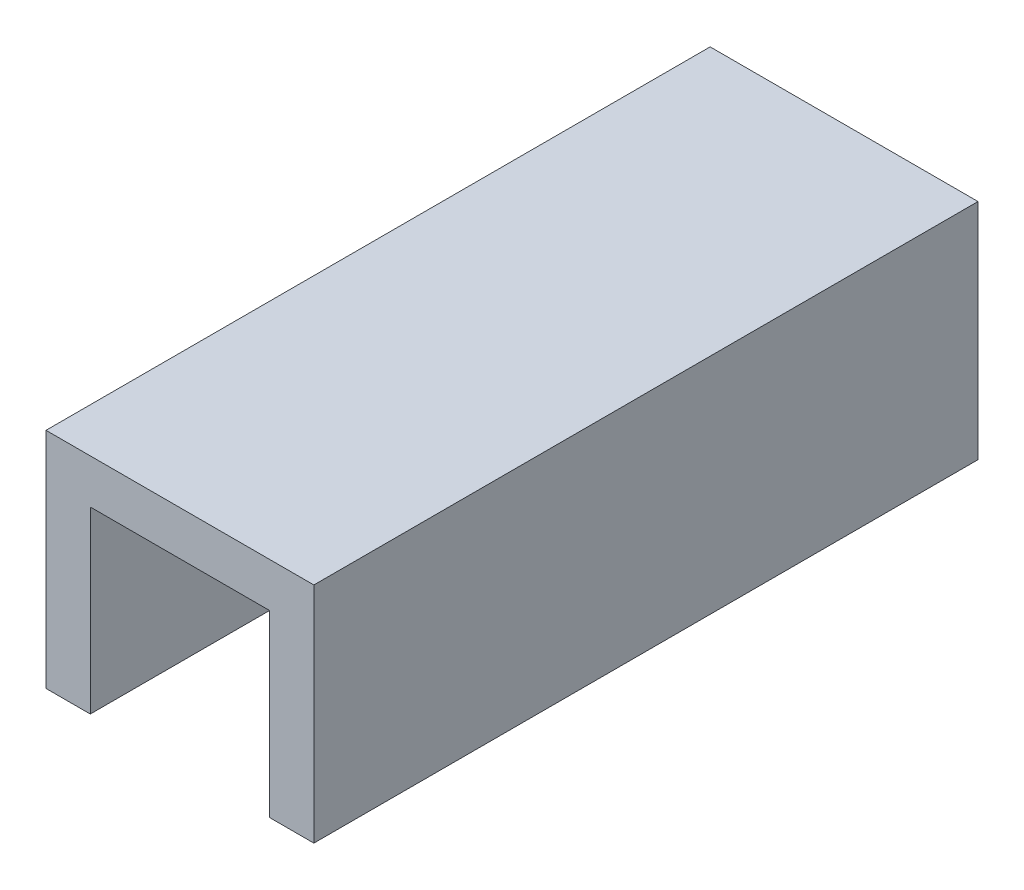
ISO-10303-21;
HEADER;
FILE_DESCRIPTION(('STEP AP214'),'2;1');
FILE_NAME('part.step','',(''),(''),'','','');
FILE_SCHEMA(('AUTOMOTIVE_DESIGN { 1 0 10303 214 1 1 1 1 }'));
ENDSEC;
DATA;
#1=APPLICATION_CONTEXT('core data for automotive mechanical design processes');
#2=APPLICATION_PROTOCOL_DEFINITION('international standard','automotive_design',2000,#1);
#3=PRODUCT_CONTEXT('',#1,'mechanical');
#4=PRODUCT('Part','Part','',(#3));
#5=PRODUCT_RELATED_PRODUCT_CATEGORY('part','',(#4));
#6=PRODUCT_DEFINITION_FORMATION('','',#4);
#7=PRODUCT_DEFINITION_CONTEXT('part definition',#1,'design');
#8=PRODUCT_DEFINITION('design','',#6,#7);
#9=PRODUCT_DEFINITION_SHAPE('','',#8);
#10=(LENGTH_UNIT() NAMED_UNIT(*) SI_UNIT(.MILLI.,.METRE.));
#11=(NAMED_UNIT(*) PLANE_ANGLE_UNIT() SI_UNIT($,.RADIAN.));
#12=(NAMED_UNIT(*) SI_UNIT($,.STERADIAN.) SOLID_ANGLE_UNIT());
#13=UNCERTAINTY_MEASURE_WITH_UNIT(LENGTH_MEASURE(1.E-05),#10,'distance_accuracy_value','');
#14=(GEOMETRIC_REPRESENTATION_CONTEXT(3) GLOBAL_UNCERTAINTY_ASSIGNED_CONTEXT((#13)) GLOBAL_UNIT_ASSIGNED_CONTEXT((#10,
#11,#12)) REPRESENTATION_CONTEXT('',''));
#15=CARTESIAN_POINT('',(0.,0.,0.));
#16=DIRECTION('',(0.,0.,1.));
#17=DIRECTION('',(1.,0.,0.));
#18=AXIS2_PLACEMENT_3D('',#15,#16,#17);
#19=CARTESIAN_POINT('',(40.5,-40.5,300.));
#20=DIRECTION('',(1.,0.,0.));
#21=DIRECTION('',(0.,1.,0.));
#22=AXIS2_PLACEMENT_3D('',#19,#20,#21);
#23=PLANE('',#22);
#24=DIRECTION('',(0.,-1.,0.));
#25=VECTOR('',#24,1.);
#26=CARTESIAN_POINT('',(40.5,-40.5,0.));
#27=LINE('',#26,#25);
#28=CARTESIAN_POINT('',(40.5,40.5,0.));
#29=VERTEX_POINT('',#28);
#30=CARTESIAN_POINT('',(40.5,-40.5,0.));
#31=VERTEX_POINT('',#30);
#32=EDGE_CURVE('E128',#29,#31,#27,.T.);
#33=ORIENTED_EDGE('',*,*,#32,.T.);
#34=DIRECTION('',(0.,0.,-1.));
#35=VECTOR('',#34,1.);
#36=CARTESIAN_POINT('',(40.5,-40.5,300.));
#37=LINE('',#36,#35);
#38=CARTESIAN_POINT('',(40.5,-40.5,300.));
#39=VERTEX_POINT('',#38);
#40=EDGE_CURVE('E11',#39,#31,#37,.T.);
#41=ORIENTED_EDGE('',*,*,#40,.F.);
#42=DIRECTION('',(0.,-1.,0.));
#43=VECTOR('',#42,1.);
#44=CARTESIAN_POINT('',(40.5,-40.5,300.));
#45=LINE('',#44,#43);
#46=CARTESIAN_POINT('',(40.5,40.5,300.));
#47=VERTEX_POINT('',#46);
#48=EDGE_CURVE('E142',#47,#39,#45,.T.);
#49=ORIENTED_EDGE('',*,*,#48,.F.);
#50=DIRECTION('',(0.,0.,-1.));
#51=VECTOR('',#50,1.);
#52=CARTESIAN_POINT('',(40.5,40.5,300.));
#53=LINE('',#52,#51);
#54=EDGE_CURVE('E124',#47,#29,#53,.T.);
#55=ORIENTED_EDGE('',*,*,#54,.T.);
#56=EDGE_LOOP('',(#33,#41,#49,#55));
#57=FACE_BOUND('',#56,.T.);
#58=ADVANCED_FACE('F32',(#57),#23,.F.);
#59=CARTESIAN_POINT('',(40.5,-40.5,300.));
#60=DIRECTION('',(0.,1.,0.));
#61=DIRECTION('',(0.,0.,1.));
#62=AXIS2_PLACEMENT_3D('',#59,#60,#61);
#63=PLANE('',#62);
#64=DIRECTION('',(1.,0.,0.));
#65=VECTOR('',#64,1.);
#66=CARTESIAN_POINT('',(40.5,-40.5,0.));
#67=LINE('',#66,#65);
#68=CARTESIAN_POINT('',(60.5,-40.5,0.));
#69=VERTEX_POINT('',#68);
#70=EDGE_CURVE('E131',#31,#69,#67,.T.);
#71=ORIENTED_EDGE('',*,*,#70,.T.);
#72=DIRECTION('',(0.,0.,-1.));
#73=VECTOR('',#72,1.);
#74=CARTESIAN_POINT('',(60.5,-40.5,300.));
#75=LINE('',#74,#73);
#76=CARTESIAN_POINT('',(60.5,-40.5,300.));
#77=VERTEX_POINT('',#76);
#78=EDGE_CURVE('E40',#77,#69,#75,.T.);
#79=ORIENTED_EDGE('',*,*,#78,.F.);
#80=DIRECTION('',(1.,0.,0.));
#81=VECTOR('',#80,1.);
#82=CARTESIAN_POINT('',(40.5,-40.5,300.));
#83=LINE('',#82,#81);
#84=EDGE_CURVE('E91',#39,#77,#83,.T.);
#85=ORIENTED_EDGE('',*,*,#84,.F.);
#86=ORIENTED_EDGE('',*,*,#40,.T.);
#87=EDGE_LOOP('',(#71,#79,#85,#86));
#88=FACE_BOUND('',#87,.T.);
#89=ADVANCED_FACE('F177',(#88),#63,.F.);
#90=CARTESIAN_POINT('',(60.5,-40.5,300.));
#91=DIRECTION('',(-1.,0.,0.));
#92=DIRECTION('',(0.,0.,1.));
#93=AXIS2_PLACEMENT_3D('',#90,#91,#92);
#94=PLANE('',#93);
#95=DIRECTION('',(0.,1.,0.));
#96=VECTOR('',#95,1.);
#97=CARTESIAN_POINT('',(60.5,-40.5,0.));
#98=LINE('',#97,#96);
#99=CARTESIAN_POINT('',(60.5,60.5,0.));
#100=VERTEX_POINT('',#99);
#101=EDGE_CURVE('E133',#69,#100,#98,.T.);
#102=ORIENTED_EDGE('',*,*,#101,.T.);
#103=DIRECTION('',(0.,0.,-1.));
#104=VECTOR('',#103,1.);
#105=CARTESIAN_POINT('',(60.5,60.5,300.));
#106=LINE('',#105,#104);
#107=CARTESIAN_POINT('',(60.5,60.5,300.));
#108=VERTEX_POINT('',#107);
#109=EDGE_CURVE('E149',#108,#100,#106,.T.);
#110=ORIENTED_EDGE('',*,*,#109,.F.);
#111=DIRECTION('',(0.,1.,0.));
#112=VECTOR('',#111,1.);
#113=CARTESIAN_POINT('',(60.5,-40.5,300.));
#114=LINE('',#113,#112);
#115=EDGE_CURVE('E157',#77,#108,#114,.T.);
#116=ORIENTED_EDGE('',*,*,#115,.F.);
#117=ORIENTED_EDGE('',*,*,#78,.T.);
#118=EDGE_LOOP('',(#102,#110,#116,#117));
#119=FACE_BOUND('',#118,.T.);
#120=ADVANCED_FACE('F155',(#119),#94,.F.);
#121=CARTESIAN_POINT('',(-60.5,60.5,300.));
#122=DIRECTION('',(0.,-1.,0.));
#123=DIRECTION('',(0.,0.,-1.));
#124=AXIS2_PLACEMENT_3D('',#121,#122,#123);
#125=PLANE('',#124);
#126=DIRECTION('',(-1.,0.,0.));
#127=VECTOR('',#126,1.);
#128=CARTESIAN_POINT('',(-60.5,60.5,0.));
#129=LINE('',#128,#127);
#130=CARTESIAN_POINT('',(-60.5,60.5,0.));
#131=VERTEX_POINT('',#130);
#132=EDGE_CURVE('E135',#100,#131,#129,.T.);
#133=ORIENTED_EDGE('',*,*,#132,.T.);
#134=DIRECTION('',(0.,0.,-1.));
#135=VECTOR('',#134,1.);
#136=CARTESIAN_POINT('',(-60.5,60.5,300.));
#137=LINE('',#136,#135);
#138=CARTESIAN_POINT('',(-60.5,60.5,300.));
#139=VERTEX_POINT('',#138);
#140=EDGE_CURVE('E146',#139,#131,#137,.T.);
#141=ORIENTED_EDGE('',*,*,#140,.F.);
#142=DIRECTION('',(-1.,0.,0.));
#143=VECTOR('',#142,1.);
#144=CARTESIAN_POINT('',(-60.5,60.5,300.));
#145=LINE('',#144,#143);
#146=EDGE_CURVE('E169',#108,#139,#145,.T.);
#147=ORIENTED_EDGE('',*,*,#146,.F.);
#148=ORIENTED_EDGE('',*,*,#109,.T.);
#149=EDGE_LOOP('',(#133,#141,#147,#148));
#150=FACE_BOUND('',#149,.T.);
#151=ADVANCED_FACE('F165',(#150),#125,.F.);
#152=CARTESIAN_POINT('',(-60.5,-40.5,300.));
#153=DIRECTION('',(1.,0.,0.));
#154=DIRECTION('',(0.,0.,-1.));
#155=AXIS2_PLACEMENT_3D('',#152,#153,#154);
#156=PLANE('',#155);
#157=DIRECTION('',(0.,-1.,0.));
#158=VECTOR('',#157,1.);
#159=CARTESIAN_POINT('',(-60.5,-40.5,0.));
#160=LINE('',#159,#158);
#161=CARTESIAN_POINT('',(-60.5,-40.5,0.));
#162=VERTEX_POINT('',#161);
#163=EDGE_CURVE('E137',#131,#162,#160,.T.);
#164=ORIENTED_EDGE('',*,*,#163,.T.);
#165=DIRECTION('',(0.,0.,-1.));
#166=VECTOR('',#165,1.);
#167=CARTESIAN_POINT('',(-60.5,-40.5,300.));
#168=LINE('',#167,#166);
#169=CARTESIAN_POINT('',(-60.5,-40.5,300.));
#170=VERTEX_POINT('',#169);
#171=EDGE_CURVE('E119',#170,#162,#168,.T.);
#172=ORIENTED_EDGE('',*,*,#171,.F.);
#173=DIRECTION('',(0.,-1.,0.));
#174=VECTOR('',#173,1.);
#175=CARTESIAN_POINT('',(-60.5,-40.5,300.));
#176=LINE('',#175,#174);
#177=EDGE_CURVE('E110',#139,#170,#176,.T.);
#178=ORIENTED_EDGE('',*,*,#177,.F.);
#179=ORIENTED_EDGE('',*,*,#140,.T.);
#180=EDGE_LOOP('',(#164,#172,#178,#179));
#181=FACE_BOUND('',#180,.T.);
#182=ADVANCED_FACE('F168',(#181),#156,.F.);
#183=CARTESIAN_POINT('',(-60.5,-40.5,300.));
#184=DIRECTION('',(0.,1.,0.));
#185=DIRECTION('',(0.,0.,1.));
#186=AXIS2_PLACEMENT_3D('',#183,#184,#185);
#187=PLANE('',#186);
#188=DIRECTION('',(1.,0.,0.));
#189=VECTOR('',#188,1.);
#190=CARTESIAN_POINT('',(-60.5,-40.5,0.));
#191=LINE('',#190,#189);
#192=CARTESIAN_POINT('',(-40.5,-40.5,0.));
#193=VERTEX_POINT('',#192);
#194=EDGE_CURVE('E118',#162,#193,#191,.T.);
#195=ORIENTED_EDGE('',*,*,#194,.T.);
#196=DIRECTION('',(0.,0.,-1.));
#197=VECTOR('',#196,1.);
#198=CARTESIAN_POINT('',(-40.5,-40.5,300.));
#199=LINE('',#198,#197);
#200=CARTESIAN_POINT('',(-40.5,-40.5,300.));
#201=VERTEX_POINT('',#200);
#202=EDGE_CURVE('E115',#201,#193,#199,.T.);
#203=ORIENTED_EDGE('',*,*,#202,.F.);
#204=DIRECTION('',(1.,0.,0.));
#205=VECTOR('',#204,1.);
#206=CARTESIAN_POINT('',(-60.5,-40.5,300.));
#207=LINE('',#206,#205);
#208=EDGE_CURVE('E104',#170,#201,#207,.T.);
#209=ORIENTED_EDGE('',*,*,#208,.F.);
#210=ORIENTED_EDGE('',*,*,#171,.T.);
#211=EDGE_LOOP('',(#195,#203,#209,#210));
#212=FACE_BOUND('',#211,.T.);
#213=ADVANCED_FACE('F116',(#212),#187,.F.);
#214=CARTESIAN_POINT('',(-40.5,-40.5,300.));
#215=DIRECTION('',(-1.,0.,0.));
#216=DIRECTION('',(0.,-1.,0.));
#217=AXIS2_PLACEMENT_3D('',#214,#215,#216);
#218=PLANE('',#217);
#219=DIRECTION('',(0.,1.,0.));
#220=VECTOR('',#219,1.);
#221=CARTESIAN_POINT('',(-40.5,-40.5,0.));
#222=LINE('',#221,#220);
#223=CARTESIAN_POINT('',(-40.5,40.5,0.));
#224=VERTEX_POINT('',#223);
#225=EDGE_CURVE('E77',#193,#224,#222,.T.);
#226=ORIENTED_EDGE('',*,*,#225,.T.);
#227=DIRECTION('',(0.,0.,-1.));
#228=VECTOR('',#227,1.);
#229=CARTESIAN_POINT('',(-40.5,40.5,300.));
#230=LINE('',#229,#228);
#231=CARTESIAN_POINT('',(-40.5,40.5,300.));
#232=VERTEX_POINT('',#231);
#233=EDGE_CURVE('E120',#232,#224,#230,.T.);
#234=ORIENTED_EDGE('',*,*,#233,.F.);
#235=DIRECTION('',(0.,1.,0.));
#236=VECTOR('',#235,1.);
#237=CARTESIAN_POINT('',(-40.5,-40.5,300.));
#238=LINE('',#237,#236);
#239=EDGE_CURVE('E108',#201,#232,#238,.T.);
#240=ORIENTED_EDGE('',*,*,#239,.F.);
#241=ORIENTED_EDGE('',*,*,#202,.T.);
#242=EDGE_LOOP('',(#226,#234,#240,#241));
#243=FACE_BOUND('',#242,.T.);
#244=ADVANCED_FACE('F122',(#243),#218,.F.);
#245=CARTESIAN_POINT('',(-40.5,40.5,300.));
#246=DIRECTION('',(0.,1.,0.));
#247=DIRECTION('',(0.,0.,1.));
#248=AXIS2_PLACEMENT_3D('',#245,#246,#247);
#249=PLANE('',#248);
#250=DIRECTION('',(1.,0.,0.));
#251=VECTOR('',#250,1.);
#252=CARTESIAN_POINT('',(-40.5,40.5,0.));
#253=LINE('',#252,#251);
#254=EDGE_CURVE('E83',#224,#29,#253,.T.);
#255=ORIENTED_EDGE('',*,*,#254,.T.);
#256=ORIENTED_EDGE('',*,*,#54,.F.);
#257=DIRECTION('',(1.,0.,0.));
#258=VECTOR('',#257,1.);
#259=CARTESIAN_POINT('',(-40.5,40.5,300.));
#260=LINE('',#259,#258);
#261=EDGE_CURVE('E48',#232,#47,#260,.T.);
#262=ORIENTED_EDGE('',*,*,#261,.F.);
#263=ORIENTED_EDGE('',*,*,#233,.T.);
#264=EDGE_LOOP('',(#255,#256,#262,#263));
#265=FACE_BOUND('',#264,.T.);
#266=ADVANCED_FACE('F193',(#265),#249,.F.);
#267=CARTESIAN_POINT('',(0.,0.,300.));
#268=DIRECTION('',(0.,0.,-1.));
#269=DIRECTION('',(-1.,0.,0.));
#270=AXIS2_PLACEMENT_3D('',#267,#268,#269);
#271=PLANE('',#270);
#272=ORIENTED_EDGE('',*,*,#48,.T.);
#273=ORIENTED_EDGE('',*,*,#84,.T.);
#274=ORIENTED_EDGE('',*,*,#115,.T.);
#275=ORIENTED_EDGE('',*,*,#146,.T.);
#276=ORIENTED_EDGE('',*,*,#177,.T.);
#277=ORIENTED_EDGE('',*,*,#208,.T.);
#278=ORIENTED_EDGE('',*,*,#239,.T.);
#279=ORIENTED_EDGE('',*,*,#261,.T.);
#280=EDGE_LOOP('',(#272,#273,#274,#275,#276,#277,#278,#279));
#281=FACE_BOUND('',#280,.T.);
#282=ADVANCED_FACE('F106',(#281),#271,.F.);
#283=CARTESIAN_POINT('',(0.,0.,0.));
#284=DIRECTION('',(0.,0.,-1.));
#285=DIRECTION('',(-1.,0.,0.));
#286=AXIS2_PLACEMENT_3D('',#283,#284,#285);
#287=PLANE('',#286);
#288=ORIENTED_EDGE('',*,*,#32,.F.);
#289=ORIENTED_EDGE('',*,*,#254,.F.);
#290=ORIENTED_EDGE('',*,*,#225,.F.);
#291=ORIENTED_EDGE('',*,*,#194,.F.);
#292=ORIENTED_EDGE('',*,*,#163,.F.);
#293=ORIENTED_EDGE('',*,*,#132,.F.);
#294=ORIENTED_EDGE('',*,*,#101,.F.);
#295=ORIENTED_EDGE('',*,*,#70,.F.);
#296=EDGE_LOOP('',(#288,#289,#290,#291,#292,#293,#294,#295));
#297=FACE_BOUND('',#296,.T.);
#298=ADVANCED_FACE('F161',(#297),#287,.T.);
#299=CLOSED_SHELL('',(#58,#89,#120,#151,#182,#213,#244,#266,#282,#298));
#300=MANIFOLD_SOLID_BREP('B2',#299);
#301=ADVANCED_BREP_SHAPE_REPRESENTATION('',(#18,#300),#14);
#302=SHAPE_DEFINITION_REPRESENTATION(#9,#301);
ENDSEC;
END-ISO-10303-21;
